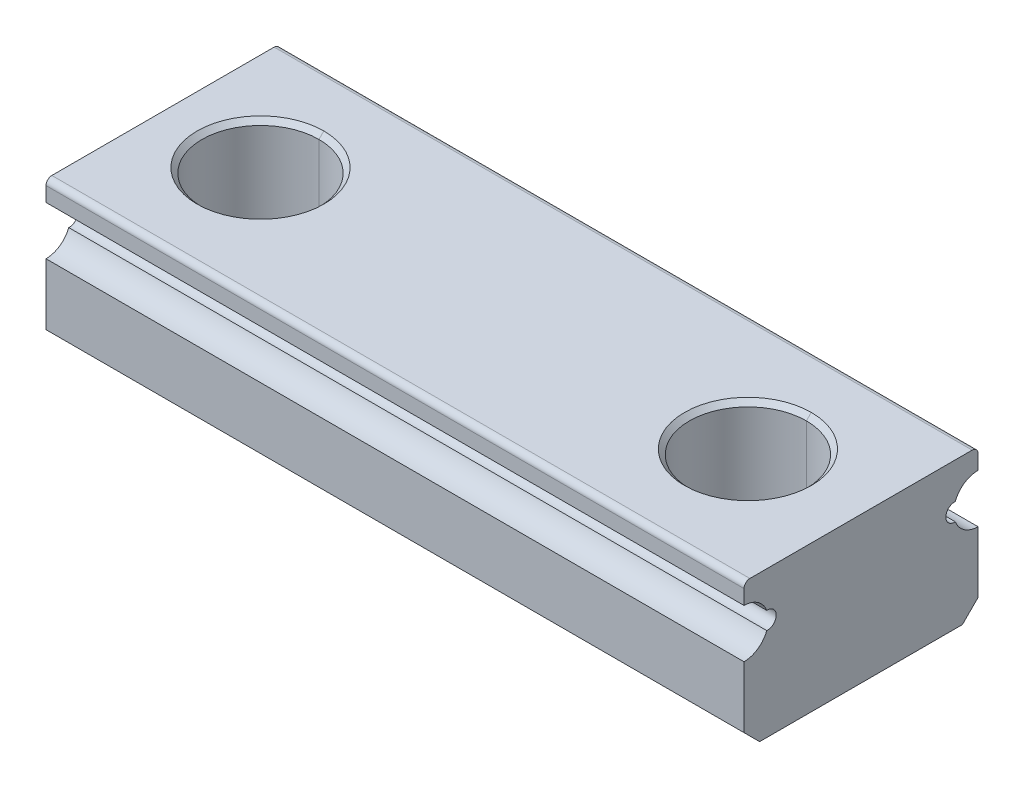
ISO-10303-21;
HEADER;
FILE_DESCRIPTION(('STEP AP214'),'2;1');
FILE_NAME('part.step','',(''),(''),'','','');
FILE_SCHEMA(('AUTOMOTIVE_DESIGN { 1 0 10303 214 1 1 1 1 }'));
ENDSEC;
DATA;
#1=APPLICATION_CONTEXT('core data for automotive mechanical design processes');
#2=APPLICATION_PROTOCOL_DEFINITION('international standard','automotive_design',2000,#1);
#3=PRODUCT_CONTEXT('',#1,'mechanical');
#4=PRODUCT('Part','Part','',(#3));
#5=PRODUCT_RELATED_PRODUCT_CATEGORY('part','',(#4));
#6=PRODUCT_DEFINITION_FORMATION('','',#4);
#7=PRODUCT_DEFINITION_CONTEXT('part definition',#1,'design');
#8=PRODUCT_DEFINITION('design','',#6,#7);
#9=PRODUCT_DEFINITION_SHAPE('','',#8);
#10=(LENGTH_UNIT() NAMED_UNIT(*) SI_UNIT(.MILLI.,.METRE.));
#11=(NAMED_UNIT(*) PLANE_ANGLE_UNIT() SI_UNIT($,.RADIAN.));
#12=(NAMED_UNIT(*) SI_UNIT($,.STERADIAN.) SOLID_ANGLE_UNIT());
#13=UNCERTAINTY_MEASURE_WITH_UNIT(LENGTH_MEASURE(1.E-05),#10,'distance_accuracy_value','');
#14=(GEOMETRIC_REPRESENTATION_CONTEXT(3) GLOBAL_UNCERTAINTY_ASSIGNED_CONTEXT((#13)) GLOBAL_UNIT_ASSIGNED_CONTEXT((#10,
#11,#12)) REPRESENTATION_CONTEXT('',''));
#15=CARTESIAN_POINT('',(0.,0.,0.));
#16=DIRECTION('',(0.,0.,1.));
#17=DIRECTION('',(1.,0.,0.));
#18=AXIS2_PLACEMENT_3D('',#15,#16,#17);
#19=CARTESIAN_POINT('',(35.8,7.20000000000012,5.70000000000013));
#20=DIRECTION('',(-1.,0.,0.));
#21=DIRECTION('',(0.,-0.70710678118656,-0.707106781186535));
#22=AXIS2_PLACEMENT_3D('',#19,#20,#21);
#23=CYLINDRICAL_SURFACE('',#22,0.299999999999876);
#24=CARTESIAN_POINT('',(0.,7.20000000000012,5.70000000000013));
#25=DIRECTION('',(1.,0.,0.));
#26=DIRECTION('',(0.,0.,-1.));
#27=AXIS2_PLACEMENT_3D('',#24,#25,#26);
#28=CIRCLE('',#27,0.299999999999876);
#29=CARTESIAN_POINT('',(0.,7.5,5.7));
#30=VERTEX_POINT('',#29);
#31=CARTESIAN_POINT('',(0.,7.2,6.));
#32=VERTEX_POINT('',#31);
#33=EDGE_CURVE('E10',#30,#32,#28,.T.);
#34=ORIENTED_EDGE('',*,*,#33,.T.);
#35=DIRECTION('',(-1.,0.,0.));
#36=VECTOR('',#35,1.);
#37=CARTESIAN_POINT('',(35.8,7.2,6.));
#38=LINE('',#37,#36);
#39=CARTESIAN_POINT('',(35.8,7.2,6.));
#40=VERTEX_POINT('',#39);
#41=EDGE_CURVE('E24',#40,#32,#38,.T.);
#42=ORIENTED_EDGE('',*,*,#41,.F.);
#43=CARTESIAN_POINT('',(35.8,7.20000000000012,5.70000000000013));
#44=DIRECTION('',(1.,0.,0.));
#45=DIRECTION('',(0.,0.,-1.));
#46=AXIS2_PLACEMENT_3D('',#43,#44,#45);
#47=CIRCLE('',#46,0.299999999999876);
#48=CARTESIAN_POINT('',(35.8,7.5,5.7));
#49=VERTEX_POINT('',#48);
#50=EDGE_CURVE('E607',#49,#40,#47,.T.);
#51=ORIENTED_EDGE('',*,*,#50,.F.);
#52=DIRECTION('',(-1.,0.,0.));
#53=VECTOR('',#52,1.);
#54=CARTESIAN_POINT('',(35.8,7.5,5.7));
#55=LINE('',#54,#53);
#56=EDGE_CURVE('E603',#49,#30,#55,.T.);
#57=ORIENTED_EDGE('',*,*,#56,.T.);
#58=EDGE_LOOP('',(#34,#42,#51,#57));
#59=FACE_BOUND('',#58,.T.);
#60=ADVANCED_FACE('F16',(#59),#23,.T.);
#61=CARTESIAN_POINT('',(35.8,7.5,-5.7));
#62=DIRECTION('',(0.,-1.,0.));
#63=DIRECTION('',(0.,0.,-1.));
#64=AXIS2_PLACEMENT_3D('',#61,#62,#63);
#65=PLANE('',#64);
#66=CARTESIAN_POINT('',(30.,7.5,0.));
#67=DIRECTION('',(0.,-1.,0.));
#68=DIRECTION('',(0.,0.,-1.));
#69=AXIS2_PLACEMENT_3D('',#66,#67,#68);
#70=CIRCLE('',#69,3.25);
#71=CARTESIAN_POINT('',(30.,7.5,-3.25));
#72=VERTEX_POINT('',#71);
#73=CARTESIAN_POINT('',(30.,7.5,3.25));
#74=VERTEX_POINT('',#73);
#75=EDGE_CURVE('E226',#72,#74,#70,.T.);
#76=ORIENTED_EDGE('',*,*,#75,.T.);
#77=CARTESIAN_POINT('',(30.,7.5,0.));
#78=DIRECTION('',(0.,-1.,0.));
#79=DIRECTION('',(0.,0.,-1.));
#80=AXIS2_PLACEMENT_3D('',#77,#78,#79);
#81=CIRCLE('',#80,3.25);
#82=EDGE_CURVE('E596',#74,#72,#81,.T.);
#83=ORIENTED_EDGE('',*,*,#82,.T.);
#84=EDGE_LOOP('',(#76,#83));
#85=FACE_BOUND('',#84,.T.);
#86=CARTESIAN_POINT('',(5.,7.5,0.));
#87=DIRECTION('',(0.,-1.,0.));
#88=DIRECTION('',(0.,0.,-1.));
#89=AXIS2_PLACEMENT_3D('',#86,#87,#88);
#90=CIRCLE('',#89,3.25);
#91=CARTESIAN_POINT('',(5.,7.5,-3.25));
#92=VERTEX_POINT('',#91);
#93=CARTESIAN_POINT('',(5.,7.5,3.25));
#94=VERTEX_POINT('',#93);
#95=EDGE_CURVE('E592',#92,#94,#90,.T.);
#96=ORIENTED_EDGE('',*,*,#95,.T.);
#97=CARTESIAN_POINT('',(5.,7.5,0.));
#98=DIRECTION('',(0.,-1.,0.));
#99=DIRECTION('',(0.,0.,-1.));
#100=AXIS2_PLACEMENT_3D('',#97,#98,#99);
#101=CIRCLE('',#100,3.25);
#102=EDGE_CURVE('E588',#94,#92,#101,.T.);
#103=ORIENTED_EDGE('',*,*,#102,.T.);
#104=EDGE_LOOP('',(#96,#103));
#105=FACE_BOUND('',#104,.T.);
#106=DIRECTION('',(0.,0.,1.));
#107=VECTOR('',#106,1.);
#108=CARTESIAN_POINT('',(0.,7.5,-5.7));
#109=LINE('',#108,#107);
#110=CARTESIAN_POINT('',(0.,7.5,-5.7));
#111=VERTEX_POINT('',#110);
#112=EDGE_CURVE('E583',#111,#30,#109,.T.);
#113=ORIENTED_EDGE('',*,*,#112,.T.);
#114=ORIENTED_EDGE('',*,*,#56,.F.);
#115=DIRECTION('',(0.,0.,1.));
#116=VECTOR('',#115,1.);
#117=CARTESIAN_POINT('',(35.8,7.5,-5.7));
#118=LINE('',#117,#116);
#119=CARTESIAN_POINT('',(35.8,7.5,-5.7));
#120=VERTEX_POINT('',#119);
#121=EDGE_CURVE('E578',#120,#49,#118,.T.);
#122=ORIENTED_EDGE('',*,*,#121,.F.);
#123=DIRECTION('',(-1.,0.,0.));
#124=VECTOR('',#123,1.);
#125=CARTESIAN_POINT('',(35.8,7.5,-5.7));
#126=LINE('',#125,#124);
#127=EDGE_CURVE('E574',#120,#111,#126,.T.);
#128=ORIENTED_EDGE('',*,*,#127,.T.);
#129=EDGE_LOOP('',(#113,#114,#122,#128));
#130=FACE_BOUND('',#129,.T.);
#131=ADVANCED_FACE('F624',(#85,#105,#130),#65,.F.);
#132=CARTESIAN_POINT('',(35.8,7.20000000000012,-5.70000000000013));
#133=DIRECTION('',(-1.,0.,0.));
#134=DIRECTION('',(0.,-0.70710678118656,0.707106781186535));
#135=AXIS2_PLACEMENT_3D('',#132,#133,#134);
#136=CYLINDRICAL_SURFACE('',#135,0.299999999999875);
#137=CARTESIAN_POINT('',(0.,7.20000000000012,-5.70000000000013));
#138=DIRECTION('',(1.,0.,0.));
#139=DIRECTION('',(0.,0.,-1.));
#140=AXIS2_PLACEMENT_3D('',#137,#138,#139);
#141=CIRCLE('',#140,0.299999999999875);
#142=CARTESIAN_POINT('',(0.,7.2,-6.));
#143=VERTEX_POINT('',#142);
#144=EDGE_CURVE('E569',#143,#111,#141,.T.);
#145=ORIENTED_EDGE('',*,*,#144,.T.);
#146=ORIENTED_EDGE('',*,*,#127,.F.);
#147=CARTESIAN_POINT('',(35.8,7.20000000000012,-5.70000000000013));
#148=DIRECTION('',(1.,0.,0.));
#149=DIRECTION('',(0.,0.,-1.));
#150=AXIS2_PLACEMENT_3D('',#147,#148,#149);
#151=CIRCLE('',#150,0.299999999999875);
#152=CARTESIAN_POINT('',(35.8,7.2,-6.));
#153=VERTEX_POINT('',#152);
#154=EDGE_CURVE('E564',#153,#120,#151,.T.);
#155=ORIENTED_EDGE('',*,*,#154,.F.);
#156=DIRECTION('',(-1.,0.,0.));
#157=VECTOR('',#156,1.);
#158=CARTESIAN_POINT('',(35.8,7.2,-6.));
#159=LINE('',#158,#157);
#160=EDGE_CURVE('E560',#153,#143,#159,.T.);
#161=ORIENTED_EDGE('',*,*,#160,.T.);
#162=EDGE_LOOP('',(#145,#146,#155,#161));
#163=FACE_BOUND('',#162,.T.);
#164=ADVANCED_FACE('F684',(#163),#136,.T.);
#165=CARTESIAN_POINT('',(35.8,6.45,-6.));
#166=DIRECTION('',(0.,0.,1.));
#167=DIRECTION('',(1.,0.,0.));
#168=AXIS2_PLACEMENT_3D('',#165,#166,#167);
#169=PLANE('',#168);
#170=DIRECTION('',(0.,1.,0.));
#171=VECTOR('',#170,1.);
#172=CARTESIAN_POINT('',(0.,6.45,-6.));
#173=LINE('',#172,#171);
#174=CARTESIAN_POINT('',(0.,6.45,-6.));
#175=VERTEX_POINT('',#174);
#176=EDGE_CURVE('E555',#175,#143,#173,.T.);
#177=ORIENTED_EDGE('',*,*,#176,.T.);
#178=ORIENTED_EDGE('',*,*,#160,.F.);
#179=DIRECTION('',(0.,1.,0.));
#180=VECTOR('',#179,1.);
#181=CARTESIAN_POINT('',(35.8,6.45,-6.));
#182=LINE('',#181,#180);
#183=CARTESIAN_POINT('',(35.8,6.45,-6.));
#184=VERTEX_POINT('',#183);
#185=EDGE_CURVE('E550',#184,#153,#182,.T.);
#186=ORIENTED_EDGE('',*,*,#185,.F.);
#187=DIRECTION('',(-1.,0.,0.));
#188=VECTOR('',#187,1.);
#189=CARTESIAN_POINT('',(35.8,6.45,-6.));
#190=LINE('',#189,#188);
#191=EDGE_CURVE('E546',#184,#175,#190,.T.);
#192=ORIENTED_EDGE('',*,*,#191,.T.);
#193=EDGE_LOOP('',(#177,#178,#186,#192));
#194=FACE_BOUND('',#193,.T.);
#195=ADVANCED_FACE('F681',(#194),#169,.F.);
#196=CARTESIAN_POINT('',(35.8,5.1999999999998,-6.0000000000001));
#197=DIRECTION('',(-1.,0.,0.));
#198=DIRECTION('',(0.,-0.824321232027402,-0.566122342280206));
#199=AXIS2_PLACEMENT_3D('',#196,#197,#198);
#200=CYLINDRICAL_SURFACE('',#199,1.2500000000002);
#201=CARTESIAN_POINT('',(0.,5.1999999999998,-6.0000000000001));
#202=DIRECTION('',(1.,0.,0.));
#203=DIRECTION('',(0.,0.,-1.));
#204=AXIS2_PLACEMENT_3D('',#201,#202,#203);
#205=CIRCLE('',#204,1.2500000000002);
#206=CARTESIAN_POINT('',(0.,5.6487637339279,-4.8333333333333));
#207=VERTEX_POINT('',#206);
#208=EDGE_CURVE('E541',#175,#207,#205,.T.);
#209=ORIENTED_EDGE('',*,*,#208,.F.);
#210=ORIENTED_EDGE('',*,*,#191,.F.);
#211=CARTESIAN_POINT('',(35.8,5.1999999999998,-6.0000000000001));
#212=DIRECTION('',(1.,0.,0.));
#213=DIRECTION('',(0.,0.,-1.));
#214=AXIS2_PLACEMENT_3D('',#211,#212,#213);
#215=CIRCLE('',#214,1.2500000000002);
#216=CARTESIAN_POINT('',(35.8,5.6487637339279,-4.8333333333333));
#217=VERTEX_POINT('',#216);
#218=EDGE_CURVE('E537',#184,#217,#215,.T.);
#219=ORIENTED_EDGE('',*,*,#218,.T.);
#220=DIRECTION('',(-1.,0.,0.));
#221=VECTOR('',#220,1.);
#222=CARTESIAN_POINT('',(35.8,5.6487637339279,-4.8333333333333));
#223=LINE('',#222,#221);
#224=EDGE_CURVE('E533',#217,#207,#223,.T.);
#225=ORIENTED_EDGE('',*,*,#224,.T.);
#226=EDGE_LOOP('',(#209,#210,#219,#225));
#227=FACE_BOUND('',#226,.T.);
#228=ADVANCED_FACE('F678',(#227),#200,.F.);
#229=CARTESIAN_POINT('',(35.8,5.2,-4.8));
#230=DIRECTION('',(-1.,0.,0.));
#231=DIRECTION('',(0.,0.,-1.));
#232=AXIS2_PLACEMENT_3D('',#229,#230,#231);
#233=CYLINDRICAL_SURFACE('',#232,0.450000000000021);
#234=CARTESIAN_POINT('',(0.,5.2,-4.8));
#235=DIRECTION('',(1.,0.,0.));
#236=DIRECTION('',(0.,0.,-1.));
#237=AXIS2_PLACEMENT_3D('',#234,#235,#236);
#238=CIRCLE('',#237,0.450000000000021);
#239=CARTESIAN_POINT('',(0.,4.7512362660721,-4.8333333333333));
#240=VERTEX_POINT('',#239);
#241=EDGE_CURVE('E528',#207,#240,#238,.T.);
#242=ORIENTED_EDGE('',*,*,#241,.F.);
#243=ORIENTED_EDGE('',*,*,#224,.F.);
#244=CARTESIAN_POINT('',(35.8,5.2,-4.8));
#245=DIRECTION('',(1.,0.,0.));
#246=DIRECTION('',(0.,0.,-1.));
#247=AXIS2_PLACEMENT_3D('',#244,#245,#246);
#248=CIRCLE('',#247,0.450000000000021);
#249=CARTESIAN_POINT('',(35.8,4.7512362660721,-4.8333333333333));
#250=VERTEX_POINT('',#249);
#251=EDGE_CURVE('E524',#217,#250,#248,.T.);
#252=ORIENTED_EDGE('',*,*,#251,.T.);
#253=DIRECTION('',(-1.,0.,0.));
#254=VECTOR('',#253,1.);
#255=CARTESIAN_POINT('',(35.8,4.7512362660721,-4.8333333333333));
#256=LINE('',#255,#254);
#257=EDGE_CURVE('E520',#250,#240,#256,.T.);
#258=ORIENTED_EDGE('',*,*,#257,.T.);
#259=EDGE_LOOP('',(#242,#243,#252,#258));
#260=FACE_BOUND('',#259,.T.);
#261=ADVANCED_FACE('F672',(#260),#233,.F.);
#262=CARTESIAN_POINT('',(35.8,5.2000000000002,-6.0000000000001));
#263=DIRECTION('',(-1.,0.,0.));
#264=DIRECTION('',(0.,0.824321232027402,-0.566122342280206));
#265=AXIS2_PLACEMENT_3D('',#262,#263,#264);
#266=CYLINDRICAL_SURFACE('',#265,1.2500000000002);
#267=CARTESIAN_POINT('',(0.,5.2000000000002,-6.0000000000001));
#268=DIRECTION('',(1.,0.,0.));
#269=DIRECTION('',(0.,0.,-1.));
#270=AXIS2_PLACEMENT_3D('',#267,#268,#269);
#271=CIRCLE('',#270,1.2500000000002);
#272=CARTESIAN_POINT('',(0.,3.95,-6.));
#273=VERTEX_POINT('',#272);
#274=EDGE_CURVE('E515',#240,#273,#271,.T.);
#275=ORIENTED_EDGE('',*,*,#274,.F.);
#276=ORIENTED_EDGE('',*,*,#257,.F.);
#277=CARTESIAN_POINT('',(35.8,5.2000000000002,-6.0000000000001));
#278=DIRECTION('',(1.,0.,0.));
#279=DIRECTION('',(0.,0.,-1.));
#280=AXIS2_PLACEMENT_3D('',#277,#278,#279);
#281=CIRCLE('',#280,1.2500000000002);
#282=CARTESIAN_POINT('',(35.8,3.95,-6.));
#283=VERTEX_POINT('',#282);
#284=EDGE_CURVE('E511',#250,#283,#281,.T.);
#285=ORIENTED_EDGE('',*,*,#284,.T.);
#286=DIRECTION('',(-1.,0.,0.));
#287=VECTOR('',#286,1.);
#288=CARTESIAN_POINT('',(35.8,3.95,-6.));
#289=LINE('',#288,#287);
#290=EDGE_CURVE('E507',#283,#273,#289,.T.);
#291=ORIENTED_EDGE('',*,*,#290,.T.);
#292=EDGE_LOOP('',(#275,#276,#285,#291));
#293=FACE_BOUND('',#292,.T.);
#294=ADVANCED_FACE('F669',(#293),#266,.F.);
#295=CARTESIAN_POINT('',(35.8,0.8,-6.));
#296=DIRECTION('',(0.,0.,1.));
#297=DIRECTION('',(1.,0.,0.));
#298=AXIS2_PLACEMENT_3D('',#295,#296,#297);
#299=PLANE('',#298);
#300=DIRECTION('',(0.,1.,0.));
#301=VECTOR('',#300,1.);
#302=CARTESIAN_POINT('',(0.,0.8,-6.));
#303=LINE('',#302,#301);
#304=CARTESIAN_POINT('',(0.,0.8,-6.));
#305=VERTEX_POINT('',#304);
#306=EDGE_CURVE('E502',#305,#273,#303,.T.);
#307=ORIENTED_EDGE('',*,*,#306,.T.);
#308=ORIENTED_EDGE('',*,*,#290,.F.);
#309=DIRECTION('',(0.,1.,0.));
#310=VECTOR('',#309,1.);
#311=CARTESIAN_POINT('',(35.8,0.8,-6.));
#312=LINE('',#311,#310);
#313=CARTESIAN_POINT('',(35.8,0.8,-6.));
#314=VERTEX_POINT('',#313);
#315=EDGE_CURVE('E497',#314,#283,#312,.T.);
#316=ORIENTED_EDGE('',*,*,#315,.F.);
#317=DIRECTION('',(-1.,0.,0.));
#318=VECTOR('',#317,1.);
#319=CARTESIAN_POINT('',(35.8,0.8,-6.));
#320=LINE('',#319,#318);
#321=EDGE_CURVE('E493',#314,#305,#320,.T.);
#322=ORIENTED_EDGE('',*,*,#321,.T.);
#323=EDGE_LOOP('',(#307,#308,#316,#322));
#324=FACE_BOUND('',#323,.T.);
#325=ADVANCED_FACE('F666',(#324),#299,.F.);
#326=CARTESIAN_POINT('',(35.8,0.,-5.2));
#327=DIRECTION('',(0.,0.707106781186547,0.707106781186548));
#328=DIRECTION('',(0.,-0.707106781186548,0.707106781186547));
#329=AXIS2_PLACEMENT_3D('',#326,#327,#328);
#330=PLANE('',#329);
#331=DIRECTION('',(0.,0.707106781186548,-0.707106781186547));
#332=VECTOR('',#331,1.);
#333=CARTESIAN_POINT('',(0.,0.,-5.2));
#334=LINE('',#333,#332);
#335=CARTESIAN_POINT('',(0.,0.,-5.2));
#336=VERTEX_POINT('',#335);
#337=EDGE_CURVE('E488',#336,#305,#334,.T.);
#338=ORIENTED_EDGE('',*,*,#337,.T.);
#339=ORIENTED_EDGE('',*,*,#321,.F.);
#340=DIRECTION('',(0.,0.707106781186548,-0.707106781186547));
#341=VECTOR('',#340,1.);
#342=CARTESIAN_POINT('',(35.8,0.,-5.2));
#343=LINE('',#342,#341);
#344=CARTESIAN_POINT('',(35.8,0.,-5.2));
#345=VERTEX_POINT('',#344);
#346=EDGE_CURVE('E483',#345,#314,#343,.T.);
#347=ORIENTED_EDGE('',*,*,#346,.F.);
#348=DIRECTION('',(-1.,0.,0.));
#349=VECTOR('',#348,1.);
#350=CARTESIAN_POINT('',(35.8,0.,-5.2));
#351=LINE('',#350,#349);
#352=EDGE_CURVE('E479',#345,#336,#351,.T.);
#353=ORIENTED_EDGE('',*,*,#352,.T.);
#354=EDGE_LOOP('',(#338,#339,#347,#353));
#355=FACE_BOUND('',#354,.T.);
#356=ADVANCED_FACE('F658',(#355),#330,.F.);
#357=CARTESIAN_POINT('',(35.8,0.,5.2));
#358=DIRECTION('',(0.,1.,0.));
#359=DIRECTION('',(0.,0.,1.));
#360=AXIS2_PLACEMENT_3D('',#357,#358,#359);
#361=PLANE('',#360);
#362=CARTESIAN_POINT('',(30.,0.,0.));
#363=DIRECTION('',(0.,-1.,0.));
#364=DIRECTION('',(0.,0.,-1.));
#365=AXIS2_PLACEMENT_3D('',#362,#363,#364);
#366=CIRCLE('',#365,2.);
#367=CARTESIAN_POINT('',(30.,0.,2.));
#368=VERTEX_POINT('',#367);
#369=CARTESIAN_POINT('',(30.,0.,-2.));
#370=VERTEX_POINT('',#369);
#371=EDGE_CURVE('E474',#368,#370,#366,.T.);
#372=ORIENTED_EDGE('',*,*,#371,.F.);
#373=CARTESIAN_POINT('',(30.,0.,0.));
#374=DIRECTION('',(0.,-1.,0.));
#375=DIRECTION('',(0.,0.,-1.));
#376=AXIS2_PLACEMENT_3D('',#373,#374,#375);
#377=CIRCLE('',#376,2.);
#378=EDGE_CURVE('E469',#370,#368,#377,.T.);
#379=ORIENTED_EDGE('',*,*,#378,.F.);
#380=EDGE_LOOP('',(#372,#379));
#381=FACE_BOUND('',#380,.T.);
#382=CARTESIAN_POINT('',(5.,0.,0.));
#383=DIRECTION('',(0.,-1.,0.));
#384=DIRECTION('',(0.,0.,-1.));
#385=AXIS2_PLACEMENT_3D('',#382,#383,#384);
#386=CIRCLE('',#385,2.);
#387=CARTESIAN_POINT('',(5.,0.,2.));
#388=VERTEX_POINT('',#387);
#389=CARTESIAN_POINT('',(5.,0.,-2.));
#390=VERTEX_POINT('',#389);
#391=EDGE_CURVE('E464',#388,#390,#386,.T.);
#392=ORIENTED_EDGE('',*,*,#391,.F.);
#393=CARTESIAN_POINT('',(5.,0.,0.));
#394=DIRECTION('',(0.,-1.,0.));
#395=DIRECTION('',(0.,0.,-1.));
#396=AXIS2_PLACEMENT_3D('',#393,#394,#395);
#397=CIRCLE('',#396,2.);
#398=EDGE_CURVE('E459',#390,#388,#397,.T.);
#399=ORIENTED_EDGE('',*,*,#398,.F.);
#400=EDGE_LOOP('',(#392,#399));
#401=FACE_BOUND('',#400,.T.);
#402=DIRECTION('',(0.,0.,-1.));
#403=VECTOR('',#402,1.);
#404=CARTESIAN_POINT('',(0.,0.,5.2));
#405=LINE('',#404,#403);
#406=CARTESIAN_POINT('',(0.,0.,5.2));
#407=VERTEX_POINT('',#406);
#408=EDGE_CURVE('E454',#407,#336,#405,.T.);
#409=ORIENTED_EDGE('',*,*,#408,.T.);
#410=ORIENTED_EDGE('',*,*,#352,.F.);
#411=DIRECTION('',(0.,0.,-1.));
#412=VECTOR('',#411,1.);
#413=CARTESIAN_POINT('',(35.8,0.,5.2));
#414=LINE('',#413,#412);
#415=CARTESIAN_POINT('',(35.8,0.,5.2));
#416=VERTEX_POINT('',#415);
#417=EDGE_CURVE('E449',#416,#345,#414,.T.);
#418=ORIENTED_EDGE('',*,*,#417,.F.);
#419=DIRECTION('',(-1.,0.,0.));
#420=VECTOR('',#419,1.);
#421=CARTESIAN_POINT('',(35.8,0.,5.2));
#422=LINE('',#421,#420);
#423=EDGE_CURVE('E445',#416,#407,#422,.T.);
#424=ORIENTED_EDGE('',*,*,#423,.T.);
#425=EDGE_LOOP('',(#409,#410,#418,#424));
#426=FACE_BOUND('',#425,.T.);
#427=ADVANCED_FACE('F655',(#381,#401,#426),#361,.F.);
#428=CARTESIAN_POINT('',(35.8,0.8,6.));
#429=DIRECTION('',(0.,0.707106781186547,-0.707106781186548));
#430=DIRECTION('',(0.,0.707106781186548,0.707106781186547));
#431=AXIS2_PLACEMENT_3D('',#428,#429,#430);
#432=PLANE('',#431);
#433=DIRECTION('',(0.,-0.707106781186548,-0.707106781186547));
#434=VECTOR('',#433,1.);
#435=CARTESIAN_POINT('',(0.,0.8,6.));
#436=LINE('',#435,#434);
#437=CARTESIAN_POINT('',(0.,0.8,6.));
#438=VERTEX_POINT('',#437);
#439=EDGE_CURVE('E440',#438,#407,#436,.T.);
#440=ORIENTED_EDGE('',*,*,#439,.T.);
#441=ORIENTED_EDGE('',*,*,#423,.F.);
#442=DIRECTION('',(0.,-0.707106781186548,-0.707106781186547));
#443=VECTOR('',#442,1.);
#444=CARTESIAN_POINT('',(35.8,0.8,6.));
#445=LINE('',#444,#443);
#446=CARTESIAN_POINT('',(35.8,0.8,6.));
#447=VERTEX_POINT('',#446);
#448=EDGE_CURVE('E435',#447,#416,#445,.T.);
#449=ORIENTED_EDGE('',*,*,#448,.F.);
#450=DIRECTION('',(-1.,0.,0.));
#451=VECTOR('',#450,1.);
#452=CARTESIAN_POINT('',(35.8,0.8,6.));
#453=LINE('',#452,#451);
#454=EDGE_CURVE('E431',#447,#438,#453,.T.);
#455=ORIENTED_EDGE('',*,*,#454,.T.);
#456=EDGE_LOOP('',(#440,#441,#449,#455));
#457=FACE_BOUND('',#456,.T.);
#458=ADVANCED_FACE('F652',(#457),#432,.F.);
#459=CARTESIAN_POINT('',(35.8,3.95,6.));
#460=DIRECTION('',(0.,0.,-1.));
#461=DIRECTION('',(-1.,0.,0.));
#462=AXIS2_PLACEMENT_3D('',#459,#460,#461);
#463=PLANE('',#462);
#464=DIRECTION('',(0.,-1.,0.));
#465=VECTOR('',#464,1.);
#466=CARTESIAN_POINT('',(0.,3.95,6.));
#467=LINE('',#466,#465);
#468=CARTESIAN_POINT('',(0.,3.95,6.));
#469=VERTEX_POINT('',#468);
#470=EDGE_CURVE('E426',#469,#438,#467,.T.);
#471=ORIENTED_EDGE('',*,*,#470,.T.);
#472=ORIENTED_EDGE('',*,*,#454,.F.);
#473=DIRECTION('',(0.,-1.,0.));
#474=VECTOR('',#473,1.);
#475=CARTESIAN_POINT('',(35.8,3.95,6.));
#476=LINE('',#475,#474);
#477=CARTESIAN_POINT('',(35.8,3.95,6.));
#478=VERTEX_POINT('',#477);
#479=EDGE_CURVE('E421',#478,#447,#476,.T.);
#480=ORIENTED_EDGE('',*,*,#479,.F.);
#481=DIRECTION('',(-1.,0.,0.));
#482=VECTOR('',#481,1.);
#483=CARTESIAN_POINT('',(35.8,3.95,6.));
#484=LINE('',#483,#482);
#485=EDGE_CURVE('E417',#478,#469,#484,.T.);
#486=ORIENTED_EDGE('',*,*,#485,.T.);
#487=EDGE_LOOP('',(#471,#472,#480,#486));
#488=FACE_BOUND('',#487,.T.);
#489=ADVANCED_FACE('F646',(#488),#463,.F.);
#490=CARTESIAN_POINT('',(35.8,5.2000000000002,6.0000000000001));
#491=DIRECTION('',(-1.,0.,0.));
#492=DIRECTION('',(0.,0.824321232027402,0.566122342280205));
#493=AXIS2_PLACEMENT_3D('',#490,#491,#492);
#494=CYLINDRICAL_SURFACE('',#493,1.2500000000002);
#495=CARTESIAN_POINT('',(0.,5.2000000000002,6.0000000000001));
#496=DIRECTION('',(1.,0.,0.));
#497=DIRECTION('',(0.,0.,-1.));
#498=AXIS2_PLACEMENT_3D('',#495,#496,#497);
#499=CIRCLE('',#498,1.2500000000002);
#500=CARTESIAN_POINT('',(0.,4.7512362660721,4.8333333333333));
#501=VERTEX_POINT('',#500);
#502=EDGE_CURVE('E412',#469,#501,#499,.T.);
#503=ORIENTED_EDGE('',*,*,#502,.F.);
#504=ORIENTED_EDGE('',*,*,#485,.F.);
#505=CARTESIAN_POINT('',(35.8,5.2000000000002,6.0000000000001));
#506=DIRECTION('',(1.,0.,0.));
#507=DIRECTION('',(0.,0.,-1.));
#508=AXIS2_PLACEMENT_3D('',#505,#506,#507);
#509=CIRCLE('',#508,1.2500000000002);
#510=CARTESIAN_POINT('',(35.8,4.7512362660721,4.8333333333333));
#511=VERTEX_POINT('',#510);
#512=EDGE_CURVE('E408',#478,#511,#509,.T.);
#513=ORIENTED_EDGE('',*,*,#512,.T.);
#514=DIRECTION('',(-1.,0.,0.));
#515=VECTOR('',#514,1.);
#516=CARTESIAN_POINT('',(35.8,4.7512362660721,4.8333333333333));
#517=LINE('',#516,#515);
#518=EDGE_CURVE('E404',#511,#501,#517,.T.);
#519=ORIENTED_EDGE('',*,*,#518,.T.);
#520=EDGE_LOOP('',(#503,#504,#513,#519));
#521=FACE_BOUND('',#520,.T.);
#522=ADVANCED_FACE('F643',(#521),#494,.F.);
#523=CARTESIAN_POINT('',(35.8,5.2,4.8));
#524=DIRECTION('',(-1.,0.,0.));
#525=DIRECTION('',(0.,0.,1.));
#526=AXIS2_PLACEMENT_3D('',#523,#524,#525);
#527=CYLINDRICAL_SURFACE('',#526,0.450000000000021);
#528=CARTESIAN_POINT('',(0.,5.2,4.8));
#529=DIRECTION('',(1.,0.,0.));
#530=DIRECTION('',(0.,0.,-1.));
#531=AXIS2_PLACEMENT_3D('',#528,#529,#530);
#532=CIRCLE('',#531,0.450000000000021);
#533=CARTESIAN_POINT('',(0.,5.6487637339279,4.8333333333333));
#534=VERTEX_POINT('',#533);
#535=EDGE_CURVE('E399',#501,#534,#532,.T.);
#536=ORIENTED_EDGE('',*,*,#535,.F.);
#537=ORIENTED_EDGE('',*,*,#518,.F.);
#538=CARTESIAN_POINT('',(35.8,5.2,4.8));
#539=DIRECTION('',(1.,0.,0.));
#540=DIRECTION('',(0.,0.,-1.));
#541=AXIS2_PLACEMENT_3D('',#538,#539,#540);
#542=CIRCLE('',#541,0.450000000000021);
#543=CARTESIAN_POINT('',(35.8,5.6487637339279,4.8333333333333));
#544=VERTEX_POINT('',#543);
#545=EDGE_CURVE('E395',#511,#544,#542,.T.);
#546=ORIENTED_EDGE('',*,*,#545,.T.);
#547=DIRECTION('',(-1.,0.,0.));
#548=VECTOR('',#547,1.);
#549=CARTESIAN_POINT('',(35.8,5.6487637339279,4.8333333333333));
#550=LINE('',#549,#548);
#551=EDGE_CURVE('E391',#544,#534,#550,.T.);
#552=ORIENTED_EDGE('',*,*,#551,.T.);
#553=EDGE_LOOP('',(#536,#537,#546,#552));
#554=FACE_BOUND('',#553,.T.);
#555=ADVANCED_FACE('F640',(#554),#527,.F.);
#556=CARTESIAN_POINT('',(35.8,5.1999999999998,6.0000000000001));
#557=DIRECTION('',(-1.,0.,0.));
#558=DIRECTION('',(0.,-0.824321232027401,0.566122342280206));
#559=AXIS2_PLACEMENT_3D('',#556,#557,#558);
#560=CYLINDRICAL_SURFACE('',#559,1.2500000000002);
#561=CARTESIAN_POINT('',(0.,5.1999999999998,6.0000000000001));
#562=DIRECTION('',(1.,0.,0.));
#563=DIRECTION('',(0.,0.,-1.));
#564=AXIS2_PLACEMENT_3D('',#561,#562,#563);
#565=CIRCLE('',#564,1.2500000000002);
#566=CARTESIAN_POINT('',(0.,6.45,6.));
#567=VERTEX_POINT('',#566);
#568=EDGE_CURVE('E386',#534,#567,#565,.T.);
#569=ORIENTED_EDGE('',*,*,#568,.F.);
#570=ORIENTED_EDGE('',*,*,#551,.F.);
#571=CARTESIAN_POINT('',(35.8,5.1999999999998,6.0000000000001));
#572=DIRECTION('',(1.,0.,0.));
#573=DIRECTION('',(0.,0.,-1.));
#574=AXIS2_PLACEMENT_3D('',#571,#572,#573);
#575=CIRCLE('',#574,1.2500000000002);
#576=CARTESIAN_POINT('',(35.8,6.45,6.));
#577=VERTEX_POINT('',#576);
#578=EDGE_CURVE('E382',#544,#577,#575,.T.);
#579=ORIENTED_EDGE('',*,*,#578,.T.);
#580=DIRECTION('',(-1.,0.,0.));
#581=VECTOR('',#580,1.);
#582=CARTESIAN_POINT('',(35.8,6.45,6.));
#583=LINE('',#582,#581);
#584=EDGE_CURVE('E378',#577,#567,#583,.T.);
#585=ORIENTED_EDGE('',*,*,#584,.T.);
#586=EDGE_LOOP('',(#569,#570,#579,#585));
#587=FACE_BOUND('',#586,.T.);
#588=ADVANCED_FACE('F634',(#587),#560,.F.);
#589=CARTESIAN_POINT('',(35.8,7.2,6.));
#590=DIRECTION('',(0.,0.,-1.));
#591=DIRECTION('',(-1.,0.,0.));
#592=AXIS2_PLACEMENT_3D('',#589,#590,#591);
#593=PLANE('',#592);
#594=DIRECTION('',(0.,-1.,0.));
#595=VECTOR('',#594,1.);
#596=CARTESIAN_POINT('',(0.,7.2,6.));
#597=LINE('',#596,#595);
#598=EDGE_CURVE('E373',#32,#567,#597,.T.);
#599=ORIENTED_EDGE('',*,*,#598,.T.);
#600=ORIENTED_EDGE('',*,*,#584,.F.);
#601=DIRECTION('',(0.,-1.,0.));
#602=VECTOR('',#601,1.);
#603=CARTESIAN_POINT('',(35.8,7.2,6.));
#604=LINE('',#603,#602);
#605=EDGE_CURVE('E368',#40,#577,#604,.T.);
#606=ORIENTED_EDGE('',*,*,#605,.F.);
#607=ORIENTED_EDGE('',*,*,#41,.T.);
#608=EDGE_LOOP('',(#599,#600,#606,#607));
#609=FACE_BOUND('',#608,.T.);
#610=ADVANCED_FACE('F617',(#609),#593,.F.);
#611=CARTESIAN_POINT('',(35.8,7.20000000000012,5.70000000000013));
#612=DIRECTION('',(1.,0.,0.));
#613=DIRECTION('',(0.,0.,-1.));
#614=AXIS2_PLACEMENT_3D('',#611,#612,#613);
#615=PLANE('',#614);
#616=ORIENTED_EDGE('',*,*,#50,.T.);
#617=ORIENTED_EDGE('',*,*,#605,.T.);
#618=ORIENTED_EDGE('',*,*,#578,.F.);
#619=ORIENTED_EDGE('',*,*,#545,.F.);
#620=ORIENTED_EDGE('',*,*,#512,.F.);
#621=ORIENTED_EDGE('',*,*,#479,.T.);
#622=ORIENTED_EDGE('',*,*,#448,.T.);
#623=ORIENTED_EDGE('',*,*,#417,.T.);
#624=ORIENTED_EDGE('',*,*,#346,.T.);
#625=ORIENTED_EDGE('',*,*,#315,.T.);
#626=ORIENTED_EDGE('',*,*,#284,.F.);
#627=ORIENTED_EDGE('',*,*,#251,.F.);
#628=ORIENTED_EDGE('',*,*,#218,.F.);
#629=ORIENTED_EDGE('',*,*,#185,.T.);
#630=ORIENTED_EDGE('',*,*,#154,.T.);
#631=ORIENTED_EDGE('',*,*,#121,.T.);
#632=EDGE_LOOP('',(#616,#617,#618,#619,#620,#621,#622,#623,#624,#625,#626,#627,#628,#629,#630,#631));
#633=FACE_BOUND('',#632,.T.);
#634=ADVANCED_FACE('F621',(#633),#615,.T.);
#635=CARTESIAN_POINT('',(0.,7.20000000000012,5.70000000000013));
#636=DIRECTION('',(1.,0.,0.));
#637=DIRECTION('',(0.,0.,-1.));
#638=AXIS2_PLACEMENT_3D('',#635,#636,#637);
#639=PLANE('',#638);
#640=ORIENTED_EDGE('',*,*,#33,.F.);
#641=ORIENTED_EDGE('',*,*,#112,.F.);
#642=ORIENTED_EDGE('',*,*,#144,.F.);
#643=ORIENTED_EDGE('',*,*,#176,.F.);
#644=ORIENTED_EDGE('',*,*,#208,.T.);
#645=ORIENTED_EDGE('',*,*,#241,.T.);
#646=ORIENTED_EDGE('',*,*,#274,.T.);
#647=ORIENTED_EDGE('',*,*,#306,.F.);
#648=ORIENTED_EDGE('',*,*,#337,.F.);
#649=ORIENTED_EDGE('',*,*,#408,.F.);
#650=ORIENTED_EDGE('',*,*,#439,.F.);
#651=ORIENTED_EDGE('',*,*,#470,.F.);
#652=ORIENTED_EDGE('',*,*,#502,.T.);
#653=ORIENTED_EDGE('',*,*,#535,.T.);
#654=ORIENTED_EDGE('',*,*,#568,.T.);
#655=ORIENTED_EDGE('',*,*,#598,.F.);
#656=EDGE_LOOP('',(#640,#641,#642,#643,#644,#645,#646,#647,#648,#649,#650,#651,#652,#653,#654,#655));
#657=FACE_BOUND('',#656,.T.);
#658=ADVANCED_FACE('F629',(#657),#639,.F.);
#659=CARTESIAN_POINT('',(5.,0.25,0.));
#660=DIRECTION('',(0.,-1.,0.));
#661=DIRECTION('',(-1.,0.,0.));
#662=AXIS2_PLACEMENT_3D('',#659,#660,#661);
#663=CONICAL_SURFACE('',#662,1.75,0.785398163397448);
#664=DIRECTION('',(0.,-0.707106781186548,0.707106781186548));
#665=VECTOR('',#664,1.);
#666=CARTESIAN_POINT('',(5.,0.25,1.75));
#667=LINE('',#666,#665);
#668=CARTESIAN_POINT('',(5.,0.25,1.75));
#669=VERTEX_POINT('',#668);
#670=EDGE_CURVE('E363',#669,#388,#667,.T.);
#671=ORIENTED_EDGE('',*,*,#670,.F.);
#672=CARTESIAN_POINT('',(5.,0.25,0.));
#673=DIRECTION('',(0.,-1.,0.));
#674=DIRECTION('',(0.,0.,-1.));
#675=AXIS2_PLACEMENT_3D('',#672,#673,#674);
#676=CIRCLE('',#675,1.75);
#677=CARTESIAN_POINT('',(5.,0.25,-1.75));
#678=VERTEX_POINT('',#677);
#679=EDGE_CURVE('E358',#678,#669,#676,.T.);
#680=ORIENTED_EDGE('',*,*,#679,.F.);
#681=DIRECTION('',(0.,-0.707106781186548,-0.707106781186548));
#682=VECTOR('',#681,1.);
#683=CARTESIAN_POINT('',(5.,0.25,-1.75));
#684=LINE('',#683,#682);
#685=EDGE_CURVE('E353',#678,#390,#684,.T.);
#686=ORIENTED_EDGE('',*,*,#685,.T.);
#687=ORIENTED_EDGE('',*,*,#398,.T.);
#688=EDGE_LOOP('',(#671,#680,#686,#687));
#689=FACE_BOUND('',#688,.T.);
#690=ADVANCED_FACE('F846',(#689),#663,.F.);
#691=CARTESIAN_POINT('',(5.,0.25,0.));
#692=DIRECTION('',(0.,-1.,0.));
#693=DIRECTION('',(1.,0.,0.));
#694=AXIS2_PLACEMENT_3D('',#691,#692,#693);
#695=CONICAL_SURFACE('',#694,1.75,0.785398163397448);
#696=ORIENTED_EDGE('',*,*,#670,.T.);
#697=ORIENTED_EDGE('',*,*,#391,.T.);
#698=ORIENTED_EDGE('',*,*,#685,.F.);
#699=CARTESIAN_POINT('',(5.,0.25,0.));
#700=DIRECTION('',(0.,-1.,0.));
#701=DIRECTION('',(0.,0.,-1.));
#702=AXIS2_PLACEMENT_3D('',#699,#700,#701);
#703=CIRCLE('',#702,1.75);
#704=EDGE_CURVE('E348',#669,#678,#703,.T.);
#705=ORIENTED_EDGE('',*,*,#704,.F.);
#706=EDGE_LOOP('',(#696,#697,#698,#705));
#707=FACE_BOUND('',#706,.T.);
#708=ADVANCED_FACE('F856',(#707),#695,.F.);
#709=CARTESIAN_POINT('',(5.,0.,0.));
#710=DIRECTION('',(0.,-1.,0.));
#711=DIRECTION('',(1.,0.,0.));
#712=AXIS2_PLACEMENT_3D('',#709,#710,#711);
#713=CYLINDRICAL_SURFACE('',#712,1.75);
#714=DIRECTION('',(0.,-1.,0.));
#715=VECTOR('',#714,1.);
#716=CARTESIAN_POINT('',(5.,3.,1.75));
#717=LINE('',#716,#715);
#718=CARTESIAN_POINT('',(5.,3.,1.75));
#719=VERTEX_POINT('',#718);
#720=EDGE_CURVE('E343',#719,#669,#717,.T.);
#721=ORIENTED_EDGE('',*,*,#720,.T.);
#722=ORIENTED_EDGE('',*,*,#704,.T.);
#723=DIRECTION('',(0.,-1.,0.));
#724=VECTOR('',#723,1.);
#725=CARTESIAN_POINT('',(5.,3.,-1.75));
#726=LINE('',#725,#724);
#727=CARTESIAN_POINT('',(5.,3.,-1.75));
#728=VERTEX_POINT('',#727);
#729=EDGE_CURVE('E338',#728,#678,#726,.T.);
#730=ORIENTED_EDGE('',*,*,#729,.F.);
#731=CARTESIAN_POINT('',(5.,3.,0.));
#732=DIRECTION('',(0.,-1.,0.));
#733=DIRECTION('',(0.,0.,-1.));
#734=AXIS2_PLACEMENT_3D('',#731,#732,#733);
#735=CIRCLE('',#734,1.75);
#736=EDGE_CURVE('E333',#719,#728,#735,.T.);
#737=ORIENTED_EDGE('',*,*,#736,.F.);
#738=EDGE_LOOP('',(#721,#722,#730,#737));
#739=FACE_BOUND('',#738,.T.);
#740=ADVANCED_FACE('F867',(#739),#713,.F.);
#741=CARTESIAN_POINT('',(8.,3.,0.));
#742=DIRECTION('',(0.,1.,0.));
#743=DIRECTION('',(0.,0.,1.));
#744=AXIS2_PLACEMENT_3D('',#741,#742,#743);
#745=PLANE('',#744);
#746=CARTESIAN_POINT('',(5.,3.,0.));
#747=DIRECTION('',(0.,-1.,0.));
#748=DIRECTION('',(0.,0.,-1.));
#749=AXIS2_PLACEMENT_3D('',#746,#747,#748);
#750=CIRCLE('',#749,1.75);
#751=EDGE_CURVE('E328',#728,#719,#750,.T.);
#752=ORIENTED_EDGE('',*,*,#751,.T.);
#753=ORIENTED_EDGE('',*,*,#736,.T.);
#754=EDGE_LOOP('',(#752,#753));
#755=FACE_BOUND('',#754,.T.);
#756=CARTESIAN_POINT('',(5.,3.,0.));
#757=DIRECTION('',(0.,-1.,0.));
#758=DIRECTION('',(0.,0.,-1.));
#759=AXIS2_PLACEMENT_3D('',#756,#757,#758);
#760=CIRCLE('',#759,3.);
#761=CARTESIAN_POINT('',(5.,3.,3.));
#762=VERTEX_POINT('',#761);
#763=CARTESIAN_POINT('',(5.,3.,-3.));
#764=VERTEX_POINT('',#763);
#765=EDGE_CURVE('E323',#762,#764,#760,.T.);
#766=ORIENTED_EDGE('',*,*,#765,.F.);
#767=CARTESIAN_POINT('',(5.,3.,0.));
#768=DIRECTION('',(0.,-1.,0.));
#769=DIRECTION('',(0.,0.,-1.));
#770=AXIS2_PLACEMENT_3D('',#767,#768,#769);
#771=CIRCLE('',#770,3.);
#772=EDGE_CURVE('E318',#764,#762,#771,.T.);
#773=ORIENTED_EDGE('',*,*,#772,.F.);
#774=EDGE_LOOP('',(#766,#773));
#775=FACE_BOUND('',#774,.T.);
#776=ADVANCED_FACE('F878',(#755,#775),#745,.T.);
#777=CARTESIAN_POINT('',(5.,0.,0.));
#778=DIRECTION('',(0.,-1.,0.));
#779=DIRECTION('',(-1.,0.,0.));
#780=AXIS2_PLACEMENT_3D('',#777,#778,#779);
#781=CYLINDRICAL_SURFACE('',#780,3.);
#782=DIRECTION('',(0.,-1.,0.));
#783=VECTOR('',#782,1.);
#784=CARTESIAN_POINT('',(5.,7.25,3.));
#785=LINE('',#784,#783);
#786=CARTESIAN_POINT('',(5.,7.25,3.));
#787=VERTEX_POINT('',#786);
#788=EDGE_CURVE('E313',#787,#762,#785,.T.);
#789=ORIENTED_EDGE('',*,*,#788,.F.);
#790=CARTESIAN_POINT('',(5.,7.25,0.));
#791=DIRECTION('',(0.,-1.,0.));
#792=DIRECTION('',(0.,0.,-1.));
#793=AXIS2_PLACEMENT_3D('',#790,#791,#792);
#794=CIRCLE('',#793,3.);
#795=CARTESIAN_POINT('',(5.,7.25,-3.));
#796=VERTEX_POINT('',#795);
#797=EDGE_CURVE('E308',#796,#787,#794,.T.);
#798=ORIENTED_EDGE('',*,*,#797,.F.);
#799=DIRECTION('',(0.,-1.,0.));
#800=VECTOR('',#799,1.);
#801=CARTESIAN_POINT('',(5.,7.25,-3.));
#802=LINE('',#801,#800);
#803=EDGE_CURVE('E303',#796,#764,#802,.T.);
#804=ORIENTED_EDGE('',*,*,#803,.T.);
#805=ORIENTED_EDGE('',*,*,#772,.T.);
#806=EDGE_LOOP('',(#789,#798,#804,#805));
#807=FACE_BOUND('',#806,.T.);
#808=ADVANCED_FACE('F889',(#807),#781,.F.);
#809=CARTESIAN_POINT('',(5.,0.,0.));
#810=DIRECTION('',(0.,-1.,0.));
#811=DIRECTION('',(1.,0.,-1.61702901641324E-09));
#812=AXIS2_PLACEMENT_3D('',#809,#810,#811);
#813=CYLINDRICAL_SURFACE('',#812,3.);
#814=ORIENTED_EDGE('',*,*,#788,.T.);
#815=ORIENTED_EDGE('',*,*,#765,.T.);
#816=ORIENTED_EDGE('',*,*,#803,.F.);
#817=CARTESIAN_POINT('',(5.,7.25,0.));
#818=DIRECTION('',(0.,-1.,0.));
#819=DIRECTION('',(0.,0.,-1.));
#820=AXIS2_PLACEMENT_3D('',#817,#818,#819);
#821=CIRCLE('',#820,3.);
#822=EDGE_CURVE('E298',#787,#796,#821,.T.);
#823=ORIENTED_EDGE('',*,*,#822,.F.);
#824=EDGE_LOOP('',(#814,#815,#816,#823));
#825=FACE_BOUND('',#824,.T.);
#826=ADVANCED_FACE('F900',(#825),#813,.F.);
#827=CARTESIAN_POINT('',(5.,7.5,0.));
#828=DIRECTION('',(0.,1.,0.));
#829=DIRECTION('',(1.,0.,0.));
#830=AXIS2_PLACEMENT_3D('',#827,#828,#829);
#831=CONICAL_SURFACE('',#830,3.25,0.78539816339745);
#832=DIRECTION('',(0.,0.707106781186546,-0.707106781186549));
#833=VECTOR('',#832,1.);
#834=CARTESIAN_POINT('',(5.,7.25,-3.));
#835=LINE('',#834,#833);
#836=EDGE_CURVE('E293',#796,#92,#835,.T.);
#837=ORIENTED_EDGE('',*,*,#836,.T.);
#838=ORIENTED_EDGE('',*,*,#102,.F.);
#839=DIRECTION('',(0.,0.707106781186546,0.707106781186549));
#840=VECTOR('',#839,1.);
#841=CARTESIAN_POINT('',(5.,7.25,3.));
#842=LINE('',#841,#840);
#843=EDGE_CURVE('E288',#787,#94,#842,.T.);
#844=ORIENTED_EDGE('',*,*,#843,.F.);
#845=ORIENTED_EDGE('',*,*,#822,.T.);
#846=EDGE_LOOP('',(#837,#838,#844,#845));
#847=FACE_BOUND('',#846,.T.);
#848=ADVANCED_FACE('F911',(#847),#831,.F.);
#849=CARTESIAN_POINT('',(5.,7.5,0.));
#850=DIRECTION('',(0.,1.,0.));
#851=DIRECTION('',(-1.,0.,0.));
#852=AXIS2_PLACEMENT_3D('',#849,#850,#851);
#853=CONICAL_SURFACE('',#852,3.25,0.78539816339745);
#854=ORIENTED_EDGE('',*,*,#836,.F.);
#855=ORIENTED_EDGE('',*,*,#797,.T.);
#856=ORIENTED_EDGE('',*,*,#843,.T.);
#857=ORIENTED_EDGE('',*,*,#95,.F.);
#858=EDGE_LOOP('',(#854,#855,#856,#857));
#859=FACE_BOUND('',#858,.T.);
#860=ADVANCED_FACE('F922',(#859),#853,.F.);
#861=CARTESIAN_POINT('',(5.,0.,0.));
#862=DIRECTION('',(0.,-1.,0.));
#863=DIRECTION('',(-1.,0.,0.));
#864=AXIS2_PLACEMENT_3D('',#861,#862,#863);
#865=CYLINDRICAL_SURFACE('',#864,1.75);
#866=ORIENTED_EDGE('',*,*,#720,.F.);
#867=ORIENTED_EDGE('',*,*,#751,.F.);
#868=ORIENTED_EDGE('',*,*,#729,.T.);
#869=ORIENTED_EDGE('',*,*,#679,.T.);
#870=EDGE_LOOP('',(#866,#867,#868,#869));
#871=FACE_BOUND('',#870,.T.);
#872=ADVANCED_FACE('F933',(#871),#865,.F.);
#873=CARTESIAN_POINT('',(30.,0.25,0.));
#874=DIRECTION('',(0.,-1.,0.));
#875=DIRECTION('',(-1.,0.,0.));
#876=AXIS2_PLACEMENT_3D('',#873,#874,#875);
#877=CONICAL_SURFACE('',#876,1.75,0.785398163397448);
#878=DIRECTION('',(0.,-0.707106781186548,0.707106781186548));
#879=VECTOR('',#878,1.);
#880=CARTESIAN_POINT('',(30.,0.25,1.75));
#881=LINE('',#880,#879);
#882=CARTESIAN_POINT('',(30.,0.25,1.75));
#883=VERTEX_POINT('',#882);
#884=EDGE_CURVE('E283',#883,#368,#881,.T.);
#885=ORIENTED_EDGE('',*,*,#884,.F.);
#886=CARTESIAN_POINT('',(30.,0.25,0.));
#887=DIRECTION('',(0.,-1.,0.));
#888=DIRECTION('',(0.,0.,-1.));
#889=AXIS2_PLACEMENT_3D('',#886,#887,#888);
#890=CIRCLE('',#889,1.75);
#891=CARTESIAN_POINT('',(30.,0.25,-1.75));
#892=VERTEX_POINT('',#891);
#893=EDGE_CURVE('E278',#892,#883,#890,.T.);
#894=ORIENTED_EDGE('',*,*,#893,.F.);
#895=DIRECTION('',(0.,-0.707106781186548,-0.707106781186548));
#896=VECTOR('',#895,1.);
#897=CARTESIAN_POINT('',(30.,0.25,-1.75));
#898=LINE('',#897,#896);
#899=EDGE_CURVE('E273',#892,#370,#898,.T.);
#900=ORIENTED_EDGE('',*,*,#899,.T.);
#901=ORIENTED_EDGE('',*,*,#378,.T.);
#902=EDGE_LOOP('',(#885,#894,#900,#901));
#903=FACE_BOUND('',#902,.T.);
#904=ADVANCED_FACE('F944',(#903),#877,.F.);
#905=CARTESIAN_POINT('',(30.,0.25,0.));
#906=DIRECTION('',(0.,-1.,0.));
#907=DIRECTION('',(1.,0.,0.));
#908=AXIS2_PLACEMENT_3D('',#905,#906,#907);
#909=CONICAL_SURFACE('',#908,1.75,0.785398163397448);
#910=ORIENTED_EDGE('',*,*,#884,.T.);
#911=ORIENTED_EDGE('',*,*,#371,.T.);
#912=ORIENTED_EDGE('',*,*,#899,.F.);
#913=CARTESIAN_POINT('',(30.,0.25,0.));
#914=DIRECTION('',(0.,-1.,0.));
#915=DIRECTION('',(0.,0.,-1.));
#916=AXIS2_PLACEMENT_3D('',#913,#914,#915);
#917=CIRCLE('',#916,1.75);
#918=EDGE_CURVE('E268',#883,#892,#917,.T.);
#919=ORIENTED_EDGE('',*,*,#918,.F.);
#920=EDGE_LOOP('',(#910,#911,#912,#919));
#921=FACE_BOUND('',#920,.T.);
#922=ADVANCED_FACE('F955',(#921),#909,.F.);
#923=CARTESIAN_POINT('',(30.,0.,0.));
#924=DIRECTION('',(0.,-1.,0.));
#925=DIRECTION('',(1.,0.,0.));
#926=AXIS2_PLACEMENT_3D('',#923,#924,#925);
#927=CYLINDRICAL_SURFACE('',#926,1.75);
#928=DIRECTION('',(0.,-1.,0.));
#929=VECTOR('',#928,1.);
#930=CARTESIAN_POINT('',(30.,3.,1.75));
#931=LINE('',#930,#929);
#932=CARTESIAN_POINT('',(30.,3.,1.75));
#933=VERTEX_POINT('',#932);
#934=EDGE_CURVE('E263',#933,#883,#931,.T.);
#935=ORIENTED_EDGE('',*,*,#934,.T.);
#936=ORIENTED_EDGE('',*,*,#918,.T.);
#937=DIRECTION('',(0.,-1.,0.));
#938=VECTOR('',#937,1.);
#939=CARTESIAN_POINT('',(30.,3.,-1.75));
#940=LINE('',#939,#938);
#941=CARTESIAN_POINT('',(30.,3.,-1.75));
#942=VERTEX_POINT('',#941);
#943=EDGE_CURVE('E258',#942,#892,#940,.T.);
#944=ORIENTED_EDGE('',*,*,#943,.F.);
#945=CARTESIAN_POINT('',(30.,3.,0.));
#946=DIRECTION('',(0.,-1.,0.));
#947=DIRECTION('',(0.,0.,-1.));
#948=AXIS2_PLACEMENT_3D('',#945,#946,#947);
#949=CIRCLE('',#948,1.75);
#950=EDGE_CURVE('E253',#933,#942,#949,.T.);
#951=ORIENTED_EDGE('',*,*,#950,.F.);
#952=EDGE_LOOP('',(#935,#936,#944,#951));
#953=FACE_BOUND('',#952,.T.);
#954=ADVANCED_FACE('F966',(#953),#927,.F.);
#955=CARTESIAN_POINT('',(33.,3.,0.));
#956=DIRECTION('',(0.,1.,0.));
#957=DIRECTION('',(0.,0.,1.));
#958=AXIS2_PLACEMENT_3D('',#955,#956,#957);
#959=PLANE('',#958);
#960=CARTESIAN_POINT('',(30.,3.,0.));
#961=DIRECTION('',(0.,-1.,0.));
#962=DIRECTION('',(0.,0.,-1.));
#963=AXIS2_PLACEMENT_3D('',#960,#961,#962);
#964=CIRCLE('',#963,1.75);
#965=EDGE_CURVE('E248',#942,#933,#964,.T.);
#966=ORIENTED_EDGE('',*,*,#965,.T.);
#967=ORIENTED_EDGE('',*,*,#950,.T.);
#968=EDGE_LOOP('',(#966,#967));
#969=FACE_BOUND('',#968,.T.);
#970=CARTESIAN_POINT('',(30.,3.,0.));
#971=DIRECTION('',(0.,-1.,0.));
#972=DIRECTION('',(0.,0.,-1.));
#973=AXIS2_PLACEMENT_3D('',#970,#971,#972);
#974=CIRCLE('',#973,3.);
#975=CARTESIAN_POINT('',(30.,3.,3.));
#976=VERTEX_POINT('',#975);
#977=CARTESIAN_POINT('',(30.,3.,-3.));
#978=VERTEX_POINT('',#977);
#979=EDGE_CURVE('E215',#976,#978,#974,.T.);
#980=ORIENTED_EDGE('',*,*,#979,.F.);
#981=CARTESIAN_POINT('',(30.,3.,0.));
#982=DIRECTION('',(0.,-1.,0.));
#983=DIRECTION('',(0.,0.,-1.));
#984=AXIS2_PLACEMENT_3D('',#981,#982,#983);
#985=CIRCLE('',#984,3.);
#986=EDGE_CURVE('E241',#978,#976,#985,.T.);
#987=ORIENTED_EDGE('',*,*,#986,.F.);
#988=EDGE_LOOP('',(#980,#987));
#989=FACE_BOUND('',#988,.T.);
#990=ADVANCED_FACE('F977',(#969,#989),#959,.T.);
#991=CARTESIAN_POINT('',(30.,0.,0.));
#992=DIRECTION('',(0.,-1.,0.));
#993=DIRECTION('',(-1.,0.,0.));
#994=AXIS2_PLACEMENT_3D('',#991,#992,#993);
#995=CYLINDRICAL_SURFACE('',#994,3.);
#996=DIRECTION('',(0.,-1.,0.));
#997=VECTOR('',#996,1.);
#998=CARTESIAN_POINT('',(30.,7.25,3.));
#999=LINE('',#998,#997);
#1000=CARTESIAN_POINT('',(30.,7.25,3.));
#1001=VERTEX_POINT('',#1000);
#1002=EDGE_CURVE('E204',#1001,#976,#999,.T.);
#1003=ORIENTED_EDGE('',*,*,#1002,.F.);
#1004=CARTESIAN_POINT('',(30.,7.25,0.));
#1005=DIRECTION('',(0.,-1.,0.));
#1006=DIRECTION('',(0.,0.,-1.));
#1007=AXIS2_PLACEMENT_3D('',#1004,#1005,#1006);
#1008=CIRCLE('',#1007,3.);
#1009=CARTESIAN_POINT('',(30.,7.25,-3.));
#1010=VERTEX_POINT('',#1009);
#1011=EDGE_CURVE('E197',#1010,#1001,#1008,.T.);
#1012=ORIENTED_EDGE('',*,*,#1011,.F.);
#1013=DIRECTION('',(0.,-1.,0.));
#1014=VECTOR('',#1013,1.);
#1015=CARTESIAN_POINT('',(30.,7.25,-3.));
#1016=LINE('',#1015,#1014);
#1017=EDGE_CURVE('E201',#1010,#978,#1016,.T.);
#1018=ORIENTED_EDGE('',*,*,#1017,.T.);
#1019=ORIENTED_EDGE('',*,*,#986,.T.);
#1020=EDGE_LOOP('',(#1003,#1012,#1018,#1019));
#1021=FACE_BOUND('',#1020,.T.);
#1022=ADVANCED_FACE('F199',(#1021),#995,.F.);
#1023=CARTESIAN_POINT('',(30.,0.,0.));
#1024=DIRECTION('',(0.,-1.,0.));
#1025=DIRECTION('',(1.,0.,-1.61702923845784E-09));
#1026=AXIS2_PLACEMENT_3D('',#1023,#1024,#1025);
#1027=CYLINDRICAL_SURFACE('',#1026,3.);
#1028=ORIENTED_EDGE('',*,*,#1002,.T.);
#1029=ORIENTED_EDGE('',*,*,#979,.T.);
#1030=ORIENTED_EDGE('',*,*,#1017,.F.);
#1031=CARTESIAN_POINT('',(30.,7.25,0.));
#1032=DIRECTION('',(0.,-1.,0.));
#1033=DIRECTION('',(0.,0.,-1.));
#1034=AXIS2_PLACEMENT_3D('',#1031,#1032,#1033);
#1035=CIRCLE('',#1034,3.);
#1036=EDGE_CURVE('E213',#1001,#1010,#1035,.T.);
#1037=ORIENTED_EDGE('',*,*,#1036,.F.);
#1038=EDGE_LOOP('',(#1028,#1029,#1030,#1037));
#1039=FACE_BOUND('',#1038,.T.);
#1040=ADVANCED_FACE('F212',(#1039),#1027,.F.);
#1041=CARTESIAN_POINT('',(30.,7.5,0.));
#1042=DIRECTION('',(0.,1.,0.));
#1043=DIRECTION('',(1.,0.,0.));
#1044=AXIS2_PLACEMENT_3D('',#1041,#1042,#1043);
#1045=CONICAL_SURFACE('',#1044,3.25,0.78539816339745);
#1046=DIRECTION('',(0.,0.707106781186546,-0.707106781186549));
#1047=VECTOR('',#1046,1.);
#1048=CARTESIAN_POINT('',(30.,7.25,-3.));
#1049=LINE('',#1048,#1047);
#1050=EDGE_CURVE('E221',#1010,#72,#1049,.T.);
#1051=ORIENTED_EDGE('',*,*,#1050,.T.);
#1052=ORIENTED_EDGE('',*,*,#82,.F.);
#1053=DIRECTION('',(0.,0.707106781186546,0.707106781186549));
#1054=VECTOR('',#1053,1.);
#1055=CARTESIAN_POINT('',(30.,7.25,3.));
#1056=LINE('',#1055,#1054);
#1057=EDGE_CURVE('E223',#1001,#74,#1056,.T.);
#1058=ORIENTED_EDGE('',*,*,#1057,.F.);
#1059=ORIENTED_EDGE('',*,*,#1036,.T.);
#1060=EDGE_LOOP('',(#1051,#1052,#1058,#1059));
#1061=FACE_BOUND('',#1060,.T.);
#1062=ADVANCED_FACE('F219',(#1061),#1045,.F.);
#1063=CARTESIAN_POINT('',(30.,7.5,0.));
#1064=DIRECTION('',(0.,1.,0.));
#1065=DIRECTION('',(-1.,0.,0.));
#1066=AXIS2_PLACEMENT_3D('',#1063,#1064,#1065);
#1067=CONICAL_SURFACE('',#1066,3.25,0.78539816339745);
#1068=ORIENTED_EDGE('',*,*,#1050,.F.);
#1069=ORIENTED_EDGE('',*,*,#1011,.T.);
#1070=ORIENTED_EDGE('',*,*,#1057,.T.);
#1071=ORIENTED_EDGE('',*,*,#75,.F.);
#1072=EDGE_LOOP('',(#1068,#1069,#1070,#1071));
#1073=FACE_BOUND('',#1072,.T.);
#1074=ADVANCED_FACE('F225',(#1073),#1067,.F.);
#1075=CARTESIAN_POINT('',(30.,0.,0.));
#1076=DIRECTION('',(0.,-1.,0.));
#1077=DIRECTION('',(-1.,0.,0.));
#1078=AXIS2_PLACEMENT_3D('',#1075,#1076,#1077);
#1079=CYLINDRICAL_SURFACE('',#1078,1.75);
#1080=ORIENTED_EDGE('',*,*,#934,.F.);
#1081=ORIENTED_EDGE('',*,*,#965,.F.);
#1082=ORIENTED_EDGE('',*,*,#943,.T.);
#1083=ORIENTED_EDGE('',*,*,#893,.T.);
#1084=EDGE_LOOP('',(#1080,#1081,#1082,#1083));
#1085=FACE_BOUND('',#1084,.T.);
#1086=ADVANCED_FACE('F1025',(#1085),#1079,.F.);
#1087=CLOSED_SHELL('',(#60,#131,#164,#195,#228,#261,#294,#325,#356,#427,#458,#489,#522,#555,
#588,#610,#634,#658,#690,#708,#740,#776,#808,#826,#848,#860,#872,#904,#922,#954,#990,#1022,
#1040,#1062,#1074,#1086));
#1088=MANIFOLD_SOLID_BREP('B1',#1087);
#1089=ADVANCED_BREP_SHAPE_REPRESENTATION('',(#18,#1088),#14);
#1090=SHAPE_DEFINITION_REPRESENTATION(#9,#1089);
ENDSEC;
END-ISO-10303-21;
